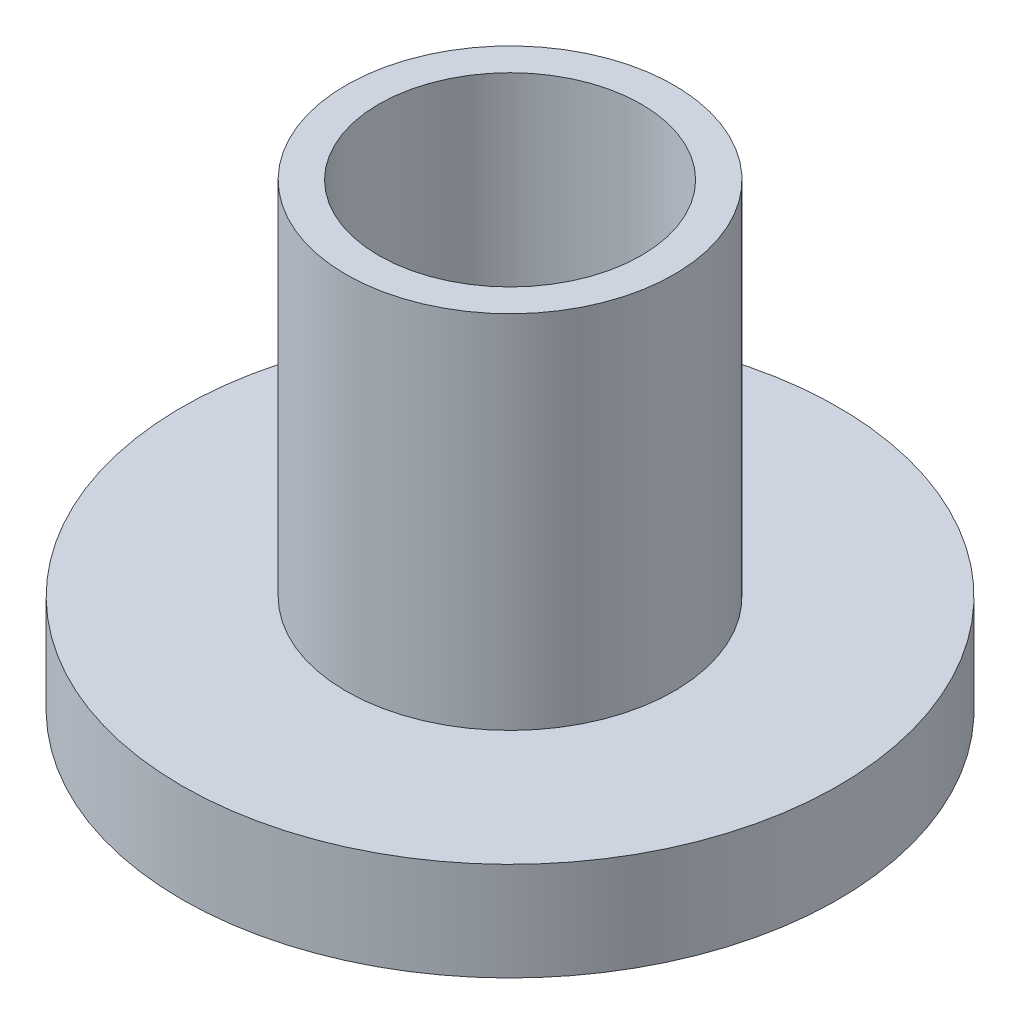
ISO-10303-21;
HEADER;
FILE_DESCRIPTION(('STEP AP214'),'2;1');
FILE_NAME('part.step','',(''),(''),'','','');
FILE_SCHEMA(('AUTOMOTIVE_DESIGN { 1 0 10303 214 1 1 1 1 }'));
ENDSEC;
DATA;
#1=APPLICATION_CONTEXT('core data for automotive mechanical design processes');
#2=APPLICATION_PROTOCOL_DEFINITION('international standard','automotive_design',2000,#1);
#3=PRODUCT_CONTEXT('',#1,'mechanical');
#4=PRODUCT('Part','Part','',(#3));
#5=PRODUCT_RELATED_PRODUCT_CATEGORY('part','',(#4));
#6=PRODUCT_DEFINITION_FORMATION('','',#4);
#7=PRODUCT_DEFINITION_CONTEXT('part definition',#1,'design');
#8=PRODUCT_DEFINITION('design','',#6,#7);
#9=PRODUCT_DEFINITION_SHAPE('','',#8);
#10=(LENGTH_UNIT() NAMED_UNIT(*) SI_UNIT(.MILLI.,.METRE.));
#11=(NAMED_UNIT(*) PLANE_ANGLE_UNIT() SI_UNIT($,.RADIAN.));
#12=(NAMED_UNIT(*) SI_UNIT($,.STERADIAN.) SOLID_ANGLE_UNIT());
#13=UNCERTAINTY_MEASURE_WITH_UNIT(LENGTH_MEASURE(1.E-05),#10,'distance_accuracy_value','');
#14=(GEOMETRIC_REPRESENTATION_CONTEXT(3) GLOBAL_UNCERTAINTY_ASSIGNED_CONTEXT((#13)) GLOBAL_UNIT_ASSIGNED_CONTEXT((#10,
#11,#12)) REPRESENTATION_CONTEXT('',''));
#15=CARTESIAN_POINT('',(0.,0.,0.));
#16=DIRECTION('',(0.,0.,1.));
#17=DIRECTION('',(1.,0.,0.));
#18=AXIS2_PLACEMENT_3D('',#15,#16,#17);
#19=CARTESIAN_POINT('',(0.,1.5,0.));
#20=DIRECTION('',(0.,1.,0.));
#21=DIRECTION('',(0.,0.,1.));
#22=AXIS2_PLACEMENT_3D('',#19,#20,#21);
#23=PLANE('',#22);
#24=CARTESIAN_POINT('',(0.,1.5,0.));
#25=DIRECTION('',(0.,1.,0.));
#26=DIRECTION('',(0.,0.,1.));
#27=AXIS2_PLACEMENT_3D('',#24,#25,#26);
#28=CIRCLE('',#27,5.);
#29=CARTESIAN_POINT('',(0.,1.5,5.));
#30=VERTEX_POINT('',#29);
#31=EDGE_CURVE('E10',#30,#30,#28,.T.);
#32=ORIENTED_EDGE('',*,*,#31,.T.);
#33=EDGE_LOOP('',(#32));
#34=FACE_BOUND('',#33,.T.);
#35=CARTESIAN_POINT('',(0.,1.5,0.));
#36=DIRECTION('',(0.,1.,0.));
#37=DIRECTION('',(0.,0.,1.));
#38=AXIS2_PLACEMENT_3D('',#35,#36,#37);
#39=CIRCLE('',#38,2.5);
#40=CARTESIAN_POINT('',(0.,1.5,2.5));
#41=VERTEX_POINT('',#40);
#42=EDGE_CURVE('E56',#41,#41,#39,.T.);
#43=ORIENTED_EDGE('',*,*,#42,.F.);
#44=EDGE_LOOP('',(#43));
#45=FACE_BOUND('',#44,.T.);
#46=ADVANCED_FACE('F37',(#34,#45),#23,.T.);
#47=CARTESIAN_POINT('',(0.,0.,0.));
#48=DIRECTION('',(0.,1.,0.));
#49=DIRECTION('',(0.,0.,1.));
#50=AXIS2_PLACEMENT_3D('',#47,#48,#49);
#51=PLANE('',#50);
#52=CARTESIAN_POINT('',(0.,0.,0.));
#53=DIRECTION('',(0.,1.,0.));
#54=DIRECTION('',(0.,0.,1.));
#55=AXIS2_PLACEMENT_3D('',#52,#53,#54);
#56=CIRCLE('',#55,5.);
#57=CARTESIAN_POINT('',(0.,0.,5.));
#58=VERTEX_POINT('',#57);
#59=EDGE_CURVE('E41',#58,#58,#56,.T.);
#60=ORIENTED_EDGE('',*,*,#59,.F.);
#61=EDGE_LOOP('',(#60));
#62=FACE_BOUND('',#61,.T.);
#63=CARTESIAN_POINT('',(0.,0.,0.));
#64=DIRECTION('',(0.,1.,0.));
#65=DIRECTION('',(0.,0.,1.));
#66=AXIS2_PLACEMENT_3D('',#63,#64,#65);
#67=CIRCLE('',#66,2.);
#68=CARTESIAN_POINT('',(0.,0.,2.));
#69=VERTEX_POINT('',#68);
#70=EDGE_CURVE('E50',#69,#69,#67,.T.);
#71=ORIENTED_EDGE('',*,*,#70,.T.);
#72=EDGE_LOOP('',(#71));
#73=FACE_BOUND('',#72,.T.);
#74=ADVANCED_FACE('F84',(#62,#73),#51,.F.);
#75=CARTESIAN_POINT('',(0.,1.5,0.));
#76=DIRECTION('',(0.,-1.,0.));
#77=DIRECTION('',(0.,0.,-1.));
#78=AXIS2_PLACEMENT_3D('',#75,#76,#77);
#79=CYLINDRICAL_SURFACE('',#78,5.);
#80=ORIENTED_EDGE('',*,*,#31,.F.);
#81=EDGE_LOOP('',(#80));
#82=FACE_BOUND('',#81,.T.);
#83=ORIENTED_EDGE('',*,*,#59,.T.);
#84=EDGE_LOOP('',(#83));
#85=FACE_BOUND('',#84,.T.);
#86=ADVANCED_FACE('F39',(#82,#85),#79,.T.);
#87=CARTESIAN_POINT('',(0.,1.5,0.));
#88=DIRECTION('',(0.,-1.,0.));
#89=DIRECTION('',(0.,0.,-1.));
#90=AXIS2_PLACEMENT_3D('',#87,#88,#89);
#91=CYLINDRICAL_SURFACE('',#90,2.);
#92=ORIENTED_EDGE('',*,*,#70,.F.);
#93=EDGE_LOOP('',(#92));
#94=FACE_BOUND('',#93,.T.);
#95=CARTESIAN_POINT('',(0.,7.,0.));
#96=DIRECTION('',(0.,1.,0.));
#97=DIRECTION('',(0.,0.,1.));
#98=AXIS2_PLACEMENT_3D('',#95,#96,#97);
#99=CIRCLE('',#98,2.);
#100=CARTESIAN_POINT('',(0.,7.,2.));
#101=VERTEX_POINT('',#100);
#102=EDGE_CURVE('E60',#101,#101,#99,.T.);
#103=ORIENTED_EDGE('',*,*,#102,.T.);
#104=EDGE_LOOP('',(#103));
#105=FACE_BOUND('',#104,.T.);
#106=ADVANCED_FACE('F68',(#94,#105),#91,.F.);
#107=CARTESIAN_POINT('',(0.,7.,0.));
#108=DIRECTION('',(0.,1.,0.));
#109=DIRECTION('',(0.,0.,1.));
#110=AXIS2_PLACEMENT_3D('',#107,#108,#109);
#111=PLANE('',#110);
#112=CARTESIAN_POINT('',(0.,7.,0.));
#113=DIRECTION('',(0.,1.,0.));
#114=DIRECTION('',(0.,0.,1.));
#115=AXIS2_PLACEMENT_3D('',#112,#113,#114);
#116=CIRCLE('',#115,2.5);
#117=CARTESIAN_POINT('',(0.,7.,2.5));
#118=VERTEX_POINT('',#117);
#119=EDGE_CURVE('E55',#118,#118,#116,.T.);
#120=ORIENTED_EDGE('',*,*,#119,.T.);
#121=EDGE_LOOP('',(#120));
#122=FACE_BOUND('',#121,.T.);
#123=ORIENTED_EDGE('',*,*,#102,.F.);
#124=EDGE_LOOP('',(#123));
#125=FACE_BOUND('',#124,.T.);
#126=ADVANCED_FACE('F70',(#122,#125),#111,.T.);
#127=CARTESIAN_POINT('',(0.,7.,0.));
#128=DIRECTION('',(0.,-1.,0.));
#129=DIRECTION('',(0.,0.,-1.));
#130=AXIS2_PLACEMENT_3D('',#127,#128,#129);
#131=CYLINDRICAL_SURFACE('',#130,2.5);
#132=ORIENTED_EDGE('',*,*,#119,.F.);
#133=EDGE_LOOP('',(#132));
#134=FACE_BOUND('',#133,.T.);
#135=ORIENTED_EDGE('',*,*,#42,.T.);
#136=EDGE_LOOP('',(#135));
#137=FACE_BOUND('',#136,.T.);
#138=ADVANCED_FACE('F72',(#134,#137),#131,.T.);
#139=CLOSED_SHELL('',(#46,#74,#86,#106,#126,#138));
#140=MANIFOLD_SOLID_BREP('B2',#139);
#141=ADVANCED_BREP_SHAPE_REPRESENTATION('',(#18,#140),#14);
#142=SHAPE_DEFINITION_REPRESENTATION(#9,#141);
ENDSEC;
END-ISO-10303-21;
